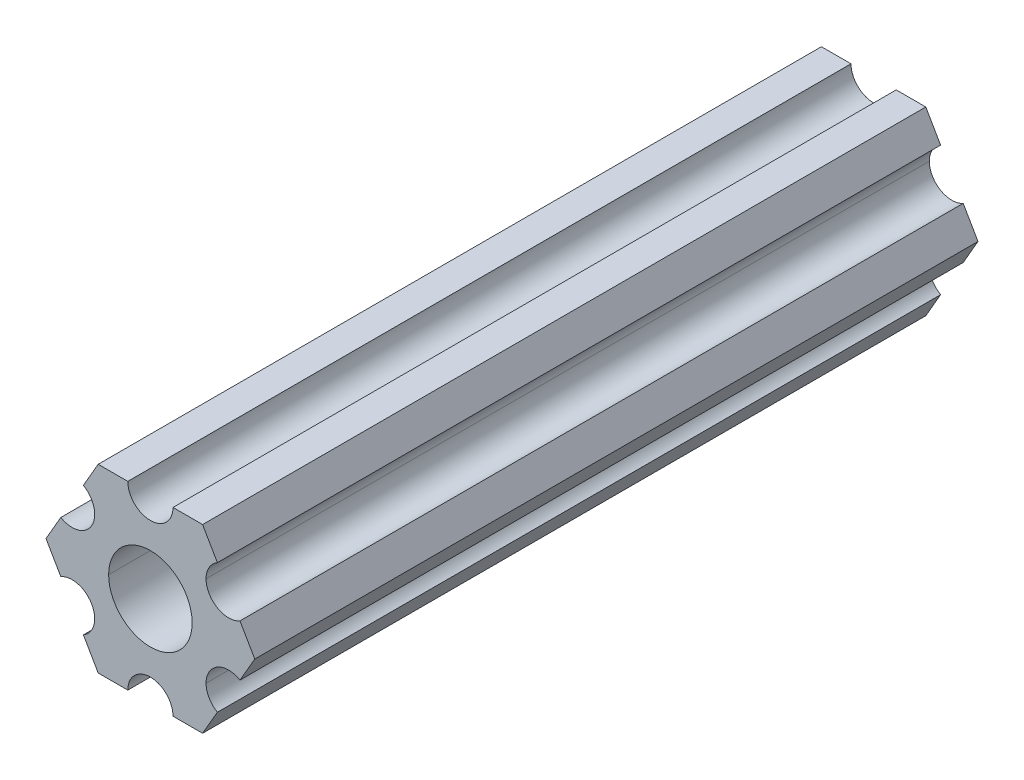
ISO-10303-21;
HEADER;
FILE_DESCRIPTION(('STEP AP214'),'2;1');
FILE_NAME('part.step','',(''),(''),'','','');
FILE_SCHEMA(('AUTOMOTIVE_DESIGN { 1 0 10303 214 1 1 1 1 }'));
ENDSEC;
DATA;
#1=APPLICATION_CONTEXT('core data for automotive mechanical design processes');
#2=APPLICATION_PROTOCOL_DEFINITION('international standard','automotive_design',2000,#1);
#3=PRODUCT_CONTEXT('',#1,'mechanical');
#4=PRODUCT('Part','Part','',(#3));
#5=PRODUCT_RELATED_PRODUCT_CATEGORY('part','',(#4));
#6=PRODUCT_DEFINITION_FORMATION('','',#4);
#7=PRODUCT_DEFINITION_CONTEXT('part definition',#1,'design');
#8=PRODUCT_DEFINITION('design','',#6,#7);
#9=PRODUCT_DEFINITION_SHAPE('','',#8);
#10=(LENGTH_UNIT() NAMED_UNIT(*) SI_UNIT(.MILLI.,.METRE.));
#11=(NAMED_UNIT(*) PLANE_ANGLE_UNIT() SI_UNIT($,.RADIAN.));
#12=(NAMED_UNIT(*) SI_UNIT($,.STERADIAN.) SOLID_ANGLE_UNIT());
#13=UNCERTAINTY_MEASURE_WITH_UNIT(LENGTH_MEASURE(1.E-05),#10,'distance_accuracy_value','');
#14=(GEOMETRIC_REPRESENTATION_CONTEXT(3) GLOBAL_UNCERTAINTY_ASSIGNED_CONTEXT((#13)) GLOBAL_UNIT_ASSIGNED_CONTEXT((#10,
#11,#12)) REPRESENTATION_CONTEXT('',''));
#15=CARTESIAN_POINT('',(0.,0.,0.));
#16=DIRECTION('',(0.,0.,1.));
#17=DIRECTION('',(1.,0.,0.));
#18=AXIS2_PLACEMENT_3D('',#15,#16,#17);
#19=CARTESIAN_POINT('',(0.,0.,304.8));
#20=DIRECTION('',(0.,0.,-1.));
#21=DIRECTION('',(-1.,0.,0.));
#22=AXIS2_PLACEMENT_3D('',#19,#20,#21);
#23=CYLINDRICAL_SURFACE('',#22,2.9337);
#24=CARTESIAN_POINT('',(0.,0.,254.));
#25=DIRECTION('',(0.,0.,-1.));
#26=DIRECTION('',(-1.,0.,0.));
#27=AXIS2_PLACEMENT_3D('',#24,#25,#26);
#28=CIRCLE('',#27,2.9337);
#29=CARTESIAN_POINT('',(-2.9337,0.,254.));
#30=VERTEX_POINT('',#29);
#31=CARTESIAN_POINT('',(2.9337,0.,254.));
#32=VERTEX_POINT('',#31);
#33=EDGE_CURVE('E72',#30,#32,#28,.F.);
#34=ORIENTED_EDGE('',*,*,#33,.F.);
#35=DIRECTION('',(0.,0.,-1.));
#36=VECTOR('',#35,1.);
#37=CARTESIAN_POINT('',(-2.9337,0.,304.8));
#38=LINE('',#37,#36);
#39=CARTESIAN_POINT('',(-2.9337,0.,304.8));
#40=VERTEX_POINT('',#39);
#41=EDGE_CURVE('E389',#40,#30,#38,.T.);
#42=ORIENTED_EDGE('',*,*,#41,.F.);
#43=CARTESIAN_POINT('',(0.,0.,304.8));
#44=DIRECTION('',(0.,0.,1.));
#45=DIRECTION('',(1.,0.,0.));
#46=AXIS2_PLACEMENT_3D('',#43,#44,#45);
#47=CIRCLE('',#46,2.9337);
#48=CARTESIAN_POINT('',(2.9337,0.,304.8));
#49=VERTEX_POINT('',#48);
#50=EDGE_CURVE('E59',#40,#49,#47,.T.);
#51=ORIENTED_EDGE('',*,*,#50,.T.);
#52=DIRECTION('',(0.,0.,-1.));
#53=VECTOR('',#52,1.);
#54=CARTESIAN_POINT('',(2.9337,0.,304.8));
#55=LINE('',#54,#53);
#56=EDGE_CURVE('E327',#49,#32,#55,.T.);
#57=ORIENTED_EDGE('',*,*,#56,.T.);
#58=EDGE_LOOP('',(#34,#42,#51,#57));
#59=FACE_BOUND('',#58,.T.);
#60=ADVANCED_FACE('F50',(#59),#23,.F.);
#61=CARTESIAN_POINT('',(5.49926150638082,-3.17499966684067,304.8));
#62=DIRECTION('',(0.,0.,-1.));
#63=DIRECTION('',(-1.,0.,0.));
#64=AXIS2_PLACEMENT_3D('',#61,#62,#63);
#65=CYLINDRICAL_SURFACE('',#64,1.5875);
#66=CARTESIAN_POINT('',(5.49926150638082,-3.17499966684067,254.));
#67=DIRECTION('',(0.,0.,-1.));
#68=DIRECTION('',(-1.,0.,0.));
#69=AXIS2_PLACEMENT_3D('',#66,#67,#68);
#70=CIRCLE('',#69,1.5875);
#71=CARTESIAN_POINT('',(6.293011423091,-1.80018429024547,254.));
#72=VERTEX_POINT('',#71);
#73=CARTESIAN_POINT('',(3.91176150638082,-3.17499966684067,254.));
#74=VERTEX_POINT('',#73);
#75=EDGE_CURVE('E66',#72,#74,#70,.F.);
#76=ORIENTED_EDGE('',*,*,#75,.F.);
#77=DIRECTION('',(0.,0.,-1.));
#78=VECTOR('',#77,1.);
#79=CARTESIAN_POINT('',(6.29301142309098,-1.80018429024546,304.8));
#80=LINE('',#79,#78);
#81=CARTESIAN_POINT('',(6.29301142309098,-1.80018429024546,304.8));
#82=VERTEX_POINT('',#81);
#83=EDGE_CURVE('E266',#82,#72,#80,.T.);
#84=ORIENTED_EDGE('',*,*,#83,.F.);
#85=CARTESIAN_POINT('',(5.49926150638082,-3.17499966684067,304.8));
#86=DIRECTION('',(0.,0.,-1.));
#87=DIRECTION('',(1.,0.,0.));
#88=AXIS2_PLACEMENT_3D('',#85,#86,#87);
#89=CIRCLE('',#88,1.5875);
#90=CARTESIAN_POINT('',(3.91176150638082,-3.17499966684067,304.8));
#91=VERTEX_POINT('',#90);
#92=EDGE_CURVE('E261',#91,#82,#89,.T.);
#93=ORIENTED_EDGE('',*,*,#92,.F.);
#94=DIRECTION('',(0.,0.,-1.));
#95=VECTOR('',#94,1.);
#96=CARTESIAN_POINT('',(3.91176150638082,-3.17499966684067,304.8));
#97=LINE('',#96,#95);
#98=EDGE_CURVE('E323',#91,#74,#97,.T.);
#99=ORIENTED_EDGE('',*,*,#98,.T.);
#100=EDGE_LOOP('',(#76,#84,#93,#99));
#101=FACE_BOUND('',#100,.T.);
#102=ADVANCED_FACE('F500',(#101),#65,.F.);
#103=CARTESIAN_POINT('',(5.49926112168156,3.17500033315934,304.8));
#104=DIRECTION('',(0.,0.,-1.));
#105=DIRECTION('',(-1.,0.,0.));
#106=AXIS2_PLACEMENT_3D('',#103,#104,#105);
#107=CYLINDRICAL_SURFACE('',#106,1.5875);
#108=CARTESIAN_POINT('',(5.49926112168156,3.17500033315934,254.));
#109=DIRECTION('',(0.,0.,-1.));
#110=DIRECTION('',(-1.,0.,0.));
#111=AXIS2_PLACEMENT_3D('',#108,#109,#110);
#112=CIRCLE('',#111,1.5875);
#113=CARTESIAN_POINT('',(4.70551103839173,4.54981561357973,254.));
#114=VERTEX_POINT('',#113);
#115=CARTESIAN_POINT('',(3.91176112168156,3.17500033315934,254.));
#116=VERTEX_POINT('',#115);
#117=EDGE_CURVE('E393',#114,#116,#112,.F.);
#118=ORIENTED_EDGE('',*,*,#117,.F.);
#119=DIRECTION('',(0.,0.,-1.));
#120=VECTOR('',#119,1.);
#121=CARTESIAN_POINT('',(4.70551103839172,4.54981561357972,304.8));
#122=LINE('',#121,#120);
#123=CARTESIAN_POINT('',(4.70551103839172,4.54981561357972,304.8));
#124=VERTEX_POINT('',#123);
#125=EDGE_CURVE('E283',#124,#114,#122,.T.);
#126=ORIENTED_EDGE('',*,*,#125,.F.);
#127=CARTESIAN_POINT('',(5.49926112168156,3.17500033315934,304.8));
#128=DIRECTION('',(0.,0.,-1.));
#129=DIRECTION('',(1.,0.,0.));
#130=AXIS2_PLACEMENT_3D('',#127,#128,#129);
#131=CIRCLE('',#130,1.5875);
#132=CARTESIAN_POINT('',(3.91176112168156,3.17500033315934,304.8));
#133=VERTEX_POINT('',#132);
#134=EDGE_CURVE('E272',#133,#124,#131,.T.);
#135=ORIENTED_EDGE('',*,*,#134,.F.);
#136=DIRECTION('',(0.,0.,-1.));
#137=VECTOR('',#136,1.);
#138=CARTESIAN_POINT('',(3.91176112168156,3.17500033315934,304.8));
#139=LINE('',#138,#137);
#140=EDGE_CURVE('E328',#133,#116,#139,.T.);
#141=ORIENTED_EDGE('',*,*,#140,.T.);
#142=EDGE_LOOP('',(#118,#126,#135,#141));
#143=FACE_BOUND('',#142,.T.);
#144=ADVANCED_FACE('F524',(#143),#107,.F.);
#145=CARTESIAN_POINT('',(6.29301142309098,-1.80018429024546,304.8));
#146=DIRECTION('',(-0.866025434075723,0.499999947533953,0.));
#147=DIRECTION('',(0.,0.,1.));
#148=AXIS2_PLACEMENT_3D('',#145,#146,#147);
#149=PLANE('',#148);
#150=DIRECTION('',(-0.49999994753396,-0.866025434075719,0.));
#151=VECTOR('',#150,1.);
#152=CARTESIAN_POINT('',(7.33234841870827,4.44212465422478E-07,254.));
#153=LINE('',#152,#151);
#154=CARTESIAN_POINT('',(7.33234841870827,4.44212465422478E-07,254.));
#155=VERTEX_POINT('',#154);
#156=EDGE_CURVE('E444',#155,#72,#153,.T.);
#157=ORIENTED_EDGE('',*,*,#156,.F.);
#158=DIRECTION('',(0.,0.,-1.));
#159=VECTOR('',#158,1.);
#160=CARTESIAN_POINT('',(7.33234841870827,4.44212519169686E-07,304.8));
#161=LINE('',#160,#159);
#162=CARTESIAN_POINT('',(7.33234841870827,4.44212519169686E-07,304.8));
#163=VERTEX_POINT('',#162);
#164=EDGE_CURVE('E300',#163,#155,#161,.T.);
#165=ORIENTED_EDGE('',*,*,#164,.F.);
#166=DIRECTION('',(0.499999947533953,0.866025434075723,0.));
#167=VECTOR('',#166,1.);
#168=CARTESIAN_POINT('',(6.29301142309098,-1.80018429024546,304.8));
#169=LINE('',#168,#167);
#170=EDGE_CURVE('E337',#82,#163,#169,.T.);
#171=ORIENTED_EDGE('',*,*,#170,.F.);
#172=ORIENTED_EDGE('',*,*,#83,.T.);
#173=EDGE_LOOP('',(#157,#165,#171,#172));
#174=FACE_BOUND('',#173,.T.);
#175=ADVANCED_FACE('F497',(#174),#149,.F.);
#176=CARTESIAN_POINT('',(7.33234841870827,4.44212519169686E-07,304.8));
#177=DIRECTION('',(-0.866025373493145,-0.500000052466057,0.));
#178=DIRECTION('',(-0.500000052466057,0.866025373493145,0.));
#179=AXIS2_PLACEMENT_3D('',#176,#177,#178);
#180=PLANE('',#179);
#181=DIRECTION('',(0.500000052466038,-0.866025373493155,0.));
#182=VECTOR('',#181,1.);
#183=CARTESIAN_POINT('',(3.66617382465485,6.35000022210625,254.));
#184=LINE('',#183,#182);
#185=CARTESIAN_POINT('',(6.29301120497141,1.80018505273896,254.));
#186=VERTEX_POINT('',#185);
#187=EDGE_CURVE('E488',#186,#155,#184,.T.);
#188=ORIENTED_EDGE('',*,*,#187,.F.);
#189=DIRECTION('',(0.,0.,-1.));
#190=VECTOR('',#189,1.);
#191=CARTESIAN_POINT('',(6.29301120497139,1.80018505273894,304.8));
#192=LINE('',#191,#190);
#193=CARTESIAN_POINT('',(6.29301120497139,1.80018505273894,304.8));
#194=VERTEX_POINT('',#193);
#195=EDGE_CURVE('E297',#194,#186,#192,.T.);
#196=ORIENTED_EDGE('',*,*,#195,.F.);
#197=DIRECTION('',(-0.500000052466056,0.866025373493145,0.));
#198=VECTOR('',#197,1.);
#199=CARTESIAN_POINT('',(7.33234841870827,4.44212519169686E-07,304.8));
#200=LINE('',#199,#198);
#201=EDGE_CURVE('E271',#163,#194,#200,.T.);
#202=ORIENTED_EDGE('',*,*,#201,.F.);
#203=ORIENTED_EDGE('',*,*,#164,.T.);
#204=EDGE_LOOP('',(#188,#196,#202,#203));
#205=FACE_BOUND('',#204,.T.);
#206=ADVANCED_FACE('F52',(#205),#180,.F.);
#207=CARTESIAN_POINT('',(5.49926112168156,3.17500033315934,304.8));
#208=DIRECTION('',(0.,0.,-1.));
#209=DIRECTION('',(-1.,0.,0.));
#210=AXIS2_PLACEMENT_3D('',#207,#208,#209);
#211=CYLINDRICAL_SURFACE('',#210,1.5875);
#212=CARTESIAN_POINT('',(5.49926112168156,3.17500033315934,254.));
#213=DIRECTION('',(0.,0.,-1.));
#214=DIRECTION('',(-1.,0.,0.));
#215=AXIS2_PLACEMENT_3D('',#212,#213,#214);
#216=CIRCLE('',#215,1.5875);
#217=EDGE_CURVE('E469',#116,#186,#216,.F.);
#218=ORIENTED_EDGE('',*,*,#217,.F.);
#219=ORIENTED_EDGE('',*,*,#140,.F.);
#220=CARTESIAN_POINT('',(5.49926112168156,3.17500033315934,304.8));
#221=DIRECTION('',(0.,0.,-1.));
#222=DIRECTION('',(1.,0.,0.));
#223=AXIS2_PLACEMENT_3D('',#220,#221,#222);
#224=CIRCLE('',#223,1.5875);
#225=EDGE_CURVE('E267',#194,#133,#224,.T.);
#226=ORIENTED_EDGE('',*,*,#225,.F.);
#227=ORIENTED_EDGE('',*,*,#195,.T.);
#228=EDGE_LOOP('',(#218,#219,#226,#227));
#229=FACE_BOUND('',#228,.T.);
#230=ADVANCED_FACE('F528',(#229),#211,.F.);
#231=CARTESIAN_POINT('',(4.70551103839172,4.54981561357972,304.8));
#232=DIRECTION('',(-0.866025373493151,-0.500000052466046,0.));
#233=DIRECTION('',(-0.500000052466046,0.866025373493151,0.));
#234=AXIS2_PLACEMENT_3D('',#231,#232,#233);
#235=PLANE('',#234);
#236=CARTESIAN_POINT('',(3.66617382465485,6.35000022210625,254.));
#237=VERTEX_POINT('',#236);
#238=EDGE_CURVE('E489',#237,#114,#184,.T.);
#239=ORIENTED_EDGE('',*,*,#238,.F.);
#240=DIRECTION('',(0.,0.,-1.));
#241=VECTOR('',#240,1.);
#242=CARTESIAN_POINT('',(3.66617382465481,6.35000022210627,304.8));
#243=LINE('',#242,#241);
#244=CARTESIAN_POINT('',(3.66617382465481,6.35000022210627,304.8));
#245=VERTEX_POINT('',#244);
#246=EDGE_CURVE('E279',#245,#237,#243,.T.);
#247=ORIENTED_EDGE('',*,*,#246,.F.);
#248=DIRECTION('',(-0.500000052466046,0.866025373493151,0.));
#249=VECTOR('',#248,1.);
#250=CARTESIAN_POINT('',(4.70551103839172,4.54981561357972,304.8));
#251=LINE('',#250,#249);
#252=EDGE_CURVE('E346',#124,#245,#251,.T.);
#253=ORIENTED_EDGE('',*,*,#252,.F.);
#254=ORIENTED_EDGE('',*,*,#125,.T.);
#255=EDGE_LOOP('',(#239,#247,#253,#254));
#256=FACE_BOUND('',#255,.T.);
#257=ADVANCED_FACE('F531',(#256),#235,.F.);
#258=CARTESIAN_POINT('',(3.66617382465481,6.35000022210627,304.8));
#259=DIRECTION('',(6.05825850611185E-08,-1.,0.));
#260=DIRECTION('',(0.,0.,-1.));
#261=AXIS2_PLACEMENT_3D('',#258,#259,#260);
#262=PLANE('',#261);
#263=DIRECTION('',(0.999999999999998,6.05825637375717E-08,0.));
#264=VECTOR('',#263,1.);
#265=CARTESIAN_POINT('',(-3.66617459405341,6.34999977789379,254.));
#266=LINE('',#265,#264);
#267=CARTESIAN_POINT('',(1.58749961530074,6.35000009617484,254.));
#268=VERTEX_POINT('',#267);
#269=EDGE_CURVE('E241',#268,#237,#266,.T.);
#270=ORIENTED_EDGE('',*,*,#269,.F.);
#271=DIRECTION('',(0.,0.,-1.));
#272=VECTOR('',#271,1.);
#273=CARTESIAN_POINT('',(1.58749961530074,6.35000009617482,304.8));
#274=LINE('',#273,#272);
#275=CARTESIAN_POINT('',(1.58749961530074,6.35000009617482,304.8));
#276=VERTEX_POINT('',#275);
#277=EDGE_CURVE('E284',#276,#268,#274,.T.);
#278=ORIENTED_EDGE('',*,*,#277,.F.);
#279=DIRECTION('',(-1.,-6.05825850611185E-08,0.));
#280=VECTOR('',#279,1.);
#281=CARTESIAN_POINT('',(3.66617382465481,6.35000022210627,304.8));
#282=LINE('',#281,#280);
#283=EDGE_CURVE('E396',#245,#276,#282,.T.);
#284=ORIENTED_EDGE('',*,*,#283,.F.);
#285=ORIENTED_EDGE('',*,*,#246,.T.);
#286=EDGE_LOOP('',(#270,#278,#284,#285));
#287=FACE_BOUND('',#286,.T.);
#288=ADVANCED_FACE('F526',(#287),#262,.F.);
#289=CARTESIAN_POINT('',(-3.84699260060323E-07,6.35,304.8));
#290=DIRECTION('',(0.,0.,-1.));
#291=DIRECTION('',(-1.,0.,0.));
#292=AXIS2_PLACEMENT_3D('',#289,#290,#291);
#293=CYLINDRICAL_SURFACE('',#292,1.5875);
#294=CARTESIAN_POINT('',(-3.84699260060323E-07,6.35,254.));
#295=DIRECTION('',(0.,0.,-1.));
#296=DIRECTION('',(-1.,0.,0.));
#297=AXIS2_PLACEMENT_3D('',#294,#295,#296);
#298=CIRCLE('',#297,1.5875);
#299=CARTESIAN_POINT('',(-1.58750038469926,6.3499999038252,254.));
#300=VERTEX_POINT('',#299);
#301=EDGE_CURVE('E466',#300,#268,#298,.F.);
#302=ORIENTED_EDGE('',*,*,#301,.F.);
#303=DIRECTION('',(0.,0.,-1.));
#304=VECTOR('',#303,1.);
#305=CARTESIAN_POINT('',(-1.58750038469926,6.34999990382519,304.8));
#306=LINE('',#305,#304);
#307=CARTESIAN_POINT('',(-1.58750038469926,6.34999990382519,304.8));
#308=VERTEX_POINT('',#307);
#309=EDGE_CURVE('E347',#308,#300,#306,.T.);
#310=ORIENTED_EDGE('',*,*,#309,.F.);
#311=CARTESIAN_POINT('',(-3.84699260060323E-07,6.35,304.8));
#312=DIRECTION('',(0.,0.,-1.));
#313=DIRECTION('',(1.,0.,0.));
#314=AXIS2_PLACEMENT_3D('',#311,#312,#313);
#315=CIRCLE('',#314,1.5875);
#316=EDGE_CURVE('E399',#276,#308,#315,.T.);
#317=ORIENTED_EDGE('',*,*,#316,.F.);
#318=ORIENTED_EDGE('',*,*,#277,.T.);
#319=EDGE_LOOP('',(#302,#310,#317,#318));
#320=FACE_BOUND('',#319,.T.);
#321=ADVANCED_FACE('F542',(#320),#293,.F.);
#322=CARTESIAN_POINT('',(-1.58750038469926,6.34999990382518,304.8));
#323=DIRECTION('',(6.05825963273174E-08,-1.,0.));
#324=DIRECTION('',(0.,0.,-1.));
#325=AXIS2_PLACEMENT_3D('',#322,#323,#324);
#326=PLANE('',#325);
#327=CARTESIAN_POINT('',(-3.66617459405341,6.34999977789379,254.));
#328=VERTEX_POINT('',#327);
#329=EDGE_CURVE('E486',#328,#300,#266,.T.);
#330=ORIENTED_EDGE('',*,*,#329,.F.);
#331=DIRECTION('',(0.,0.,-1.));
#332=VECTOR('',#331,1.);
#333=CARTESIAN_POINT('',(-3.66617459405349,6.3499997778937,304.8));
#334=LINE('',#333,#332);
#335=CARTESIAN_POINT('',(-3.66617459405349,6.3499997778937,304.8));
#336=VERTEX_POINT('',#335);
#337=EDGE_CURVE('E287',#336,#328,#334,.T.);
#338=ORIENTED_EDGE('',*,*,#337,.F.);
#339=DIRECTION('',(-1.,-6.05825963273174E-08,0.));
#340=VECTOR('',#339,1.);
#341=CARTESIAN_POINT('',(-1.58750038469926,6.34999990382518,304.8));
#342=LINE('',#341,#340);
#343=EDGE_CURVE('E374',#308,#336,#342,.T.);
#344=ORIENTED_EDGE('',*,*,#343,.F.);
#345=ORIENTED_EDGE('',*,*,#309,.T.);
#346=EDGE_LOOP('',(#330,#338,#344,#345));
#347=FACE_BOUND('',#346,.T.);
#348=ADVANCED_FACE('F538',(#347),#326,.F.);
#349=CARTESIAN_POINT('',(-3.66617459405349,6.3499997778937,304.8));
#350=DIRECTION('',(0.866025434075729,-0.499999947533942,0.));
#351=DIRECTION('',(0.,0.,-1.));
#352=AXIS2_PLACEMENT_3D('',#349,#350,#351);
#353=PLANE('',#352);
#354=DIRECTION('',(0.49999994753396,0.866025434075719,0.));
#355=VECTOR('',#354,1.);
#356=CARTESIAN_POINT('',(-7.33234841870827,-4.44212463687754E-07,254.));
#357=LINE('',#356,#355);
#358=CARTESIAN_POINT('',(-4.70551158967067,4.54981504343588,254.));
#359=VERTEX_POINT('',#358);
#360=EDGE_CURVE('E242',#359,#328,#357,.T.);
#361=ORIENTED_EDGE('',*,*,#360,.F.);
#362=DIRECTION('',(0.,0.,-1.));
#363=VECTOR('',#362,1.);
#364=CARTESIAN_POINT('',(-4.70551158967065,4.54981504343587,304.8));
#365=LINE('',#364,#363);
#366=CARTESIAN_POINT('',(-4.70551158967065,4.54981504343587,304.8));
#367=VERTEX_POINT('',#366);
#368=EDGE_CURVE('E254',#367,#359,#365,.T.);
#369=ORIENTED_EDGE('',*,*,#368,.F.);
#370=DIRECTION('',(-0.499999947533943,-0.866025434075729,0.));
#371=VECTOR('',#370,1.);
#372=CARTESIAN_POINT('',(-3.66617459405349,6.3499997778937,304.8));
#373=LINE('',#372,#371);
#374=EDGE_CURVE('E277',#336,#367,#373,.T.);
#375=ORIENTED_EDGE('',*,*,#374,.F.);
#376=ORIENTED_EDGE('',*,*,#337,.T.);
#377=EDGE_LOOP('',(#361,#369,#375,#376));
#378=FACE_BOUND('',#377,.T.);
#379=ADVANCED_FACE('F541',(#378),#353,.F.);
#380=CARTESIAN_POINT('',(-5.49926150638082,3.17499966684067,304.8));
#381=DIRECTION('',(0.,0.,-1.));
#382=DIRECTION('',(-1.,0.,0.));
#383=AXIS2_PLACEMENT_3D('',#380,#381,#382);
#384=CYLINDRICAL_SURFACE('',#383,1.5875);
#385=CARTESIAN_POINT('',(-5.49926150638082,3.17499966684067,254.));
#386=DIRECTION('',(0.,0.,-1.));
#387=DIRECTION('',(-1.,0.,0.));
#388=AXIS2_PLACEMENT_3D('',#385,#386,#387);
#389=CIRCLE('',#388,1.5875);
#390=CARTESIAN_POINT('',(-6.29301142309099,1.80018429024547,254.));
#391=VERTEX_POINT('',#390);
#392=EDGE_CURVE('E463',#391,#359,#389,.F.);
#393=ORIENTED_EDGE('',*,*,#392,.F.);
#394=DIRECTION('',(0.,0.,-1.));
#395=VECTOR('',#394,1.);
#396=CARTESIAN_POINT('',(-6.29301142309098,1.80018429024547,304.8));
#397=LINE('',#396,#395);
#398=CARTESIAN_POINT('',(-6.29301142309098,1.80018429024547,304.8));
#399=VERTEX_POINT('',#398);
#400=EDGE_CURVE('E239',#399,#391,#397,.T.);
#401=ORIENTED_EDGE('',*,*,#400,.F.);
#402=CARTESIAN_POINT('',(-5.49926150638082,3.17499966684067,304.8));
#403=DIRECTION('',(0.,0.,-1.));
#404=DIRECTION('',(1.,0.,0.));
#405=AXIS2_PLACEMENT_3D('',#402,#403,#404);
#406=CIRCLE('',#405,1.5875);
#407=EDGE_CURVE('E273',#367,#399,#406,.T.);
#408=ORIENTED_EDGE('',*,*,#407,.F.);
#409=ORIENTED_EDGE('',*,*,#368,.T.);
#410=EDGE_LOOP('',(#393,#401,#408,#409));
#411=FACE_BOUND('',#410,.T.);
#412=ADVANCED_FACE('F558',(#411),#384,.F.);
#413=CARTESIAN_POINT('',(-6.29301142309098,1.80018429024547,304.8));
#414=DIRECTION('',(0.866025434075724,-0.499999947533952,0.));
#415=DIRECTION('',(0.,0.,-1.));
#416=AXIS2_PLACEMENT_3D('',#413,#414,#415);
#417=PLANE('',#416);
#418=CARTESIAN_POINT('',(-7.33234841870827,-4.44212463687754E-07,254.));
#419=VERTEX_POINT('',#418);
#420=EDGE_CURVE('E222',#419,#391,#357,.T.);
#421=ORIENTED_EDGE('',*,*,#420,.F.);
#422=DIRECTION('',(0.,0.,-1.));
#423=VECTOR('',#422,1.);
#424=CARTESIAN_POINT('',(-7.33234841870827,-4.44212523790841E-07,304.8));
#425=LINE('',#424,#423);
#426=CARTESIAN_POINT('',(-7.33234841870827,-4.44212523790841E-07,304.8));
#427=VERTEX_POINT('',#426);
#428=EDGE_CURVE('E237',#427,#419,#425,.T.);
#429=ORIENTED_EDGE('',*,*,#428,.F.);
#430=DIRECTION('',(-0.499999947533951,-0.866025434075724,0.));
#431=VECTOR('',#430,1.);
#432=CARTESIAN_POINT('',(-6.29301142309098,1.80018429024547,304.8));
#433=LINE('',#432,#431);
#434=EDGE_CURVE('E278',#399,#427,#433,.T.);
#435=ORIENTED_EDGE('',*,*,#434,.F.);
#436=ORIENTED_EDGE('',*,*,#400,.T.);
#437=EDGE_LOOP('',(#421,#429,#435,#436));
#438=FACE_BOUND('',#437,.T.);
#439=ADVANCED_FACE('F236',(#438),#417,.F.);
#440=CARTESIAN_POINT('',(-7.33234841870827,-4.44212523790841E-07,304.8));
#441=DIRECTION('',(0.866025373493151,0.500000052466045,0.));
#442=DIRECTION('',(0.,0.,-1.));
#443=AXIS2_PLACEMENT_3D('',#440,#441,#442);
#444=PLANE('',#443);
#445=DIRECTION('',(-0.500000052466038,0.866025373493155,0.));
#446=VECTOR('',#445,1.);
#447=CARTESIAN_POINT('',(-3.66617382465485,-6.35000022210625,254.));
#448=LINE('',#447,#446);
#449=CARTESIAN_POINT('',(-6.29301120497141,-1.80018505273896,254.));
#450=VERTEX_POINT('',#449);
#451=EDGE_CURVE('E219',#450,#419,#448,.T.);
#452=ORIENTED_EDGE('',*,*,#451,.F.);
#453=DIRECTION('',(0.,0.,-1.));
#454=VECTOR('',#453,1.);
#455=CARTESIAN_POINT('',(-6.29301120497141,-1.80018505273897,304.8));
#456=LINE('',#455,#454);
#457=CARTESIAN_POINT('',(-6.29301120497141,-1.80018505273897,304.8));
#458=VERTEX_POINT('',#457);
#459=EDGE_CURVE('E249',#458,#450,#456,.T.);
#460=ORIENTED_EDGE('',*,*,#459,.F.);
#461=DIRECTION('',(0.500000052466045,-0.866025373493151,0.));
#462=VECTOR('',#461,1.);
#463=CARTESIAN_POINT('',(-7.33234841870827,-4.44212523790841E-07,304.8));
#464=LINE('',#463,#462);
#465=EDGE_CURVE('E246',#427,#458,#464,.T.);
#466=ORIENTED_EDGE('',*,*,#465,.F.);
#467=ORIENTED_EDGE('',*,*,#428,.T.);
#468=EDGE_LOOP('',(#452,#460,#466,#467));
#469=FACE_BOUND('',#468,.T.);
#470=ADVANCED_FACE('F244',(#469),#444,.F.);
#471=CARTESIAN_POINT('',(-5.49926112168156,-3.17500033315934,304.8));
#472=DIRECTION('',(0.,0.,-1.));
#473=DIRECTION('',(-1.,0.,0.));
#474=AXIS2_PLACEMENT_3D('',#471,#472,#473);
#475=CYLINDRICAL_SURFACE('',#474,1.5875);
#476=CARTESIAN_POINT('',(-5.49926112168156,-3.17500033315934,254.));
#477=DIRECTION('',(0.,0.,-1.));
#478=DIRECTION('',(-1.,0.,0.));
#479=AXIS2_PLACEMENT_3D('',#476,#477,#478);
#480=CIRCLE('',#479,1.5875);
#481=CARTESIAN_POINT('',(-4.70551103839173,-4.54981561357973,254.));
#482=VERTEX_POINT('',#481);
#483=EDGE_CURVE('E225',#482,#450,#480,.F.);
#484=ORIENTED_EDGE('',*,*,#483,.F.);
#485=DIRECTION('',(0.,0.,-1.));
#486=VECTOR('',#485,1.);
#487=CARTESIAN_POINT('',(-4.70551103839172,-4.54981561357972,304.8));
#488=LINE('',#487,#486);
#489=CARTESIAN_POINT('',(-4.70551103839172,-4.54981561357972,304.8));
#490=VERTEX_POINT('',#489);
#491=EDGE_CURVE('E256',#490,#482,#488,.T.);
#492=ORIENTED_EDGE('',*,*,#491,.F.);
#493=CARTESIAN_POINT('',(-5.49926112168156,-3.17500033315934,304.8));
#494=DIRECTION('',(0.,0.,-1.));
#495=DIRECTION('',(1.,0.,0.));
#496=AXIS2_PLACEMENT_3D('',#493,#494,#495);
#497=CIRCLE('',#496,1.5875);
#498=EDGE_CURVE('E318',#458,#490,#497,.T.);
#499=ORIENTED_EDGE('',*,*,#498,.F.);
#500=ORIENTED_EDGE('',*,*,#459,.T.);
#501=EDGE_LOOP('',(#484,#492,#499,#500));
#502=FACE_BOUND('',#501,.T.);
#503=ADVANCED_FACE('F549',(#502),#475,.F.);
#504=CARTESIAN_POINT('',(-4.70551103839172,-4.54981561357972,304.8));
#505=DIRECTION('',(0.866025373493152,0.500000052466045,0.));
#506=DIRECTION('',(0.,0.,-1.));
#507=AXIS2_PLACEMENT_3D('',#504,#505,#506);
#508=PLANE('',#507);
#509=CARTESIAN_POINT('',(-3.66617382465485,-6.35000022210625,254.));
#510=VERTEX_POINT('',#509);
#511=EDGE_CURVE('E231',#510,#482,#448,.T.);
#512=ORIENTED_EDGE('',*,*,#511,.F.);
#513=DIRECTION('',(0.,0.,-1.));
#514=VECTOR('',#513,1.);
#515=CARTESIAN_POINT('',(-3.66617382465481,-6.35000022210628,304.8));
#516=LINE('',#515,#514);
#517=CARTESIAN_POINT('',(-3.66617382465481,-6.35000022210628,304.8));
#518=VERTEX_POINT('',#517);
#519=EDGE_CURVE('E338',#518,#510,#516,.T.);
#520=ORIENTED_EDGE('',*,*,#519,.F.);
#521=DIRECTION('',(0.500000052466045,-0.866025373493152,0.));
#522=VECTOR('',#521,1.);
#523=CARTESIAN_POINT('',(-4.70551103839172,-4.54981561357972,304.8));
#524=LINE('',#523,#522);
#525=EDGE_CURVE('E322',#490,#518,#524,.T.);
#526=ORIENTED_EDGE('',*,*,#525,.F.);
#527=ORIENTED_EDGE('',*,*,#491,.T.);
#528=EDGE_LOOP('',(#512,#520,#526,#527));
#529=FACE_BOUND('',#528,.T.);
#530=ADVANCED_FACE('F482',(#529),#508,.F.);
#531=CARTESIAN_POINT('',(-3.66617382465481,-6.35000022210628,304.8));
#532=DIRECTION('',(-6.05825854783851E-08,1.,0.));
#533=DIRECTION('',(0.,0.,1.));
#534=AXIS2_PLACEMENT_3D('',#531,#532,#533);
#535=PLANE('',#534);
#536=DIRECTION('',(-0.999999999999998,-6.05825637375717E-08,0.));
#537=VECTOR('',#536,1.);
#538=CARTESIAN_POINT('',(3.66617459405341,-6.34999977789379,254.));
#539=LINE('',#538,#537);
#540=CARTESIAN_POINT('',(-1.58749961530073,-6.35000009617484,254.));
#541=VERTEX_POINT('',#540);
#542=EDGE_CURVE('E439',#541,#510,#539,.T.);
#543=ORIENTED_EDGE('',*,*,#542,.F.);
#544=DIRECTION('',(0.,0.,-1.));
#545=VECTOR('',#544,1.);
#546=CARTESIAN_POINT('',(-1.58749961530073,-6.35000009617482,304.8));
#547=LINE('',#546,#545);
#548=CARTESIAN_POINT('',(-1.58749961530073,-6.35000009617482,304.8));
#549=VERTEX_POINT('',#548);
#550=EDGE_CURVE('E342',#549,#541,#547,.T.);
#551=ORIENTED_EDGE('',*,*,#550,.F.);
#552=DIRECTION('',(1.,6.05825854783851E-08,0.));
#553=VECTOR('',#552,1.);
#554=CARTESIAN_POINT('',(-3.66617382465481,-6.35000022210628,304.8));
#555=LINE('',#554,#553);
#556=EDGE_CURVE('E329',#518,#549,#555,.T.);
#557=ORIENTED_EDGE('',*,*,#556,.F.);
#558=ORIENTED_EDGE('',*,*,#519,.T.);
#559=EDGE_LOOP('',(#543,#551,#557,#558));
#560=FACE_BOUND('',#559,.T.);
#561=ADVANCED_FACE('F437',(#560),#535,.F.);
#562=CARTESIAN_POINT('',(3.8469926204343E-07,-6.35,304.8));
#563=DIRECTION('',(0.,0.,-1.));
#564=DIRECTION('',(-1.,0.,0.));
#565=AXIS2_PLACEMENT_3D('',#562,#563,#564);
#566=CYLINDRICAL_SURFACE('',#565,1.5875);
#567=CARTESIAN_POINT('',(3.8469926204343E-07,-6.35,254.));
#568=DIRECTION('',(0.,0.,-1.));
#569=DIRECTION('',(-1.,0.,0.));
#570=AXIS2_PLACEMENT_3D('',#567,#568,#569);
#571=CIRCLE('',#570,1.5875);
#572=CARTESIAN_POINT('',(1.58750038469926,-6.3499999038252,254.));
#573=VERTEX_POINT('',#572);
#574=EDGE_CURVE('E433',#573,#541,#571,.F.);
#575=ORIENTED_EDGE('',*,*,#574,.F.);
#576=DIRECTION('',(0.,0.,-1.));
#577=VECTOR('',#576,1.);
#578=CARTESIAN_POINT('',(1.58750038469926,-6.34999990382518,304.8));
#579=LINE('',#578,#577);
#580=CARTESIAN_POINT('',(1.58750038469926,-6.34999990382518,304.8));
#581=VERTEX_POINT('',#580);
#582=EDGE_CURVE('E293',#581,#573,#579,.T.);
#583=ORIENTED_EDGE('',*,*,#582,.F.);
#584=CARTESIAN_POINT('',(3.8469926204343E-07,-6.35,304.8));
#585=DIRECTION('',(0.,0.,-1.));
#586=DIRECTION('',(1.,0.,0.));
#587=AXIS2_PLACEMENT_3D('',#584,#585,#586);
#588=CIRCLE('',#587,1.5875);
#589=EDGE_CURVE('E333',#549,#581,#588,.T.);
#590=ORIENTED_EDGE('',*,*,#589,.F.);
#591=ORIENTED_EDGE('',*,*,#550,.T.);
#592=EDGE_LOOP('',(#575,#583,#590,#591));
#593=FACE_BOUND('',#592,.T.);
#594=ADVANCED_FACE('F432',(#593),#566,.F.);
#595=CARTESIAN_POINT('',(1.58750038469926,-6.34999990382518,304.8));
#596=DIRECTION('',(-6.05825721258438E-08,1.,0.));
#597=DIRECTION('',(0.,0.,1.));
#598=AXIS2_PLACEMENT_3D('',#595,#596,#597);
#599=PLANE('',#598);
#600=CARTESIAN_POINT('',(3.66617459405341,-6.34999977789379,254.));
#601=VERTEX_POINT('',#600);
#602=EDGE_CURVE('E443',#601,#573,#539,.T.);
#603=ORIENTED_EDGE('',*,*,#602,.F.);
#604=DIRECTION('',(0.,0.,-1.));
#605=VECTOR('',#604,1.);
#606=CARTESIAN_POINT('',(3.66617459405346,-6.34999977789375,304.8));
#607=LINE('',#606,#605);
#608=CARTESIAN_POINT('',(3.66617459405346,-6.34999977789375,304.8));
#609=VERTEX_POINT('',#608);
#610=EDGE_CURVE('E289',#609,#601,#607,.T.);
#611=ORIENTED_EDGE('',*,*,#610,.F.);
#612=DIRECTION('',(1.,6.05825721258438E-08,0.));
#613=VECTOR('',#612,1.);
#614=CARTESIAN_POINT('',(1.58750038469926,-6.34999990382518,304.8));
#615=LINE('',#614,#613);
#616=EDGE_CURVE('E357',#581,#609,#615,.T.);
#617=ORIENTED_EDGE('',*,*,#616,.F.);
#618=ORIENTED_EDGE('',*,*,#582,.T.);
#619=EDGE_LOOP('',(#603,#611,#617,#618));
#620=FACE_BOUND('',#619,.T.);
#621=ADVANCED_FACE('F506',(#620),#599,.F.);
#622=CARTESIAN_POINT('',(3.66617459405346,-6.34999977789375,304.8));
#623=DIRECTION('',(-0.86602543407573,0.499999947533941,0.));
#624=DIRECTION('',(0.,0.,1.));
#625=AXIS2_PLACEMENT_3D('',#622,#623,#624);
#626=PLANE('',#625);
#627=CARTESIAN_POINT('',(4.70551158967067,-4.54981504343588,254.));
#628=VERTEX_POINT('',#627);
#629=EDGE_CURVE('E448',#628,#601,#153,.T.);
#630=ORIENTED_EDGE('',*,*,#629,.F.);
#631=DIRECTION('',(0.,0.,-1.));
#632=VECTOR('',#631,1.);
#633=CARTESIAN_POINT('',(4.70551158967065,-4.54981504343587,304.8));
#634=LINE('',#633,#632);
#635=CARTESIAN_POINT('',(4.70551158967065,-4.54981504343587,304.8));
#636=VERTEX_POINT('',#635);
#637=EDGE_CURVE('E294',#636,#628,#634,.T.);
#638=ORIENTED_EDGE('',*,*,#637,.F.);
#639=DIRECTION('',(0.499999947533941,0.86602543407573,0.));
#640=VECTOR('',#639,1.);
#641=CARTESIAN_POINT('',(3.66617459405346,-6.34999977789375,304.8));
#642=LINE('',#641,#640);
#643=EDGE_CURVE('E361',#609,#636,#642,.T.);
#644=ORIENTED_EDGE('',*,*,#643,.F.);
#645=ORIENTED_EDGE('',*,*,#610,.T.);
#646=EDGE_LOOP('',(#630,#638,#644,#645));
#647=FACE_BOUND('',#646,.T.);
#648=ADVANCED_FACE('F505',(#647),#626,.F.);
#649=CARTESIAN_POINT('',(5.49926150638082,-3.17499966684067,304.8));
#650=DIRECTION('',(0.,0.,-1.));
#651=DIRECTION('',(-1.,0.,0.));
#652=AXIS2_PLACEMENT_3D('',#649,#650,#651);
#653=CYLINDRICAL_SURFACE('',#652,1.5875);
#654=CARTESIAN_POINT('',(5.49926150638082,-3.17499966684067,254.));
#655=DIRECTION('',(0.,0.,-1.));
#656=DIRECTION('',(-1.,0.,0.));
#657=AXIS2_PLACEMENT_3D('',#654,#655,#656);
#658=CIRCLE('',#657,1.5875);
#659=EDGE_CURVE('E454',#74,#628,#658,.F.);
#660=ORIENTED_EDGE('',*,*,#659,.F.);
#661=ORIENTED_EDGE('',*,*,#98,.F.);
#662=CARTESIAN_POINT('',(5.49926150638082,-3.17499966684067,304.8));
#663=DIRECTION('',(0.,0.,-1.));
#664=DIRECTION('',(1.,0.,0.));
#665=AXIS2_PLACEMENT_3D('',#662,#663,#664);
#666=CIRCLE('',#665,1.5875);
#667=EDGE_CURVE('E265',#636,#91,#666,.T.);
#668=ORIENTED_EDGE('',*,*,#667,.F.);
#669=ORIENTED_EDGE('',*,*,#637,.T.);
#670=EDGE_LOOP('',(#660,#661,#668,#669));
#671=FACE_BOUND('',#670,.T.);
#672=ADVANCED_FACE('F502',(#671),#653,.F.);
#673=CARTESIAN_POINT('',(0.,0.,304.8));
#674=DIRECTION('',(0.,0.,-1.));
#675=DIRECTION('',(-1.,0.,0.));
#676=AXIS2_PLACEMENT_3D('',#673,#674,#675);
#677=CYLINDRICAL_SURFACE('',#676,2.9337);
#678=CARTESIAN_POINT('',(0.,0.,254.));
#679=DIRECTION('',(0.,0.,-1.));
#680=DIRECTION('',(-1.,0.,0.));
#681=AXIS2_PLACEMENT_3D('',#678,#679,#680);
#682=CIRCLE('',#681,2.9337);
#683=EDGE_CURVE('E11',#32,#30,#682,.F.);
#684=ORIENTED_EDGE('',*,*,#683,.F.);
#685=ORIENTED_EDGE('',*,*,#56,.F.);
#686=CARTESIAN_POINT('',(0.,0.,304.8));
#687=DIRECTION('',(0.,0.,1.));
#688=DIRECTION('',(1.,0.,0.));
#689=AXIS2_PLACEMENT_3D('',#686,#687,#688);
#690=CIRCLE('',#689,2.9337);
#691=EDGE_CURVE('E385',#49,#40,#690,.T.);
#692=ORIENTED_EDGE('',*,*,#691,.T.);
#693=ORIENTED_EDGE('',*,*,#41,.T.);
#694=EDGE_LOOP('',(#684,#685,#692,#693));
#695=FACE_BOUND('',#694,.T.);
#696=ADVANCED_FACE('F552',(#695),#677,.F.);
#697=CARTESIAN_POINT('',(5.49926112168156,3.17500033315934,304.8));
#698=DIRECTION('',(0.,0.,1.));
#699=DIRECTION('',(1.,0.,0.));
#700=AXIS2_PLACEMENT_3D('',#697,#698,#699);
#701=PLANE('',#700);
#702=ORIENTED_EDGE('',*,*,#170,.T.);
#703=ORIENTED_EDGE('',*,*,#201,.T.);
#704=ORIENTED_EDGE('',*,*,#225,.T.);
#705=ORIENTED_EDGE('',*,*,#134,.T.);
#706=ORIENTED_EDGE('',*,*,#252,.T.);
#707=ORIENTED_EDGE('',*,*,#283,.T.);
#708=ORIENTED_EDGE('',*,*,#316,.T.);
#709=ORIENTED_EDGE('',*,*,#343,.T.);
#710=ORIENTED_EDGE('',*,*,#374,.T.);
#711=ORIENTED_EDGE('',*,*,#407,.T.);
#712=ORIENTED_EDGE('',*,*,#434,.T.);
#713=ORIENTED_EDGE('',*,*,#465,.T.);
#714=ORIENTED_EDGE('',*,*,#498,.T.);
#715=ORIENTED_EDGE('',*,*,#525,.T.);
#716=ORIENTED_EDGE('',*,*,#556,.T.);
#717=ORIENTED_EDGE('',*,*,#589,.T.);
#718=ORIENTED_EDGE('',*,*,#616,.T.);
#719=ORIENTED_EDGE('',*,*,#643,.T.);
#720=ORIENTED_EDGE('',*,*,#667,.T.);
#721=ORIENTED_EDGE('',*,*,#92,.T.);
#722=EDGE_LOOP('',(#702,#703,#704,#705,#706,#707,#708,#709,#710,#711,#712,#713,#714,#715,#716,
#717,#718,#719,#720,#721));
#723=FACE_BOUND('',#722,.T.);
#724=ORIENTED_EDGE('',*,*,#50,.F.);
#725=ORIENTED_EDGE('',*,*,#691,.F.);
#726=EDGE_LOOP('',(#724,#725));
#727=FACE_BOUND('',#726,.T.);
#728=ADVANCED_FACE('F477',(#723,#727),#701,.T.);
#729=CARTESIAN_POINT('',(0.,0.,254.));
#730=DIRECTION('',(0.,0.,-1.));
#731=DIRECTION('',(-1.,0.,0.));
#732=AXIS2_PLACEMENT_3D('',#729,#730,#731);
#733=PLANE('',#732);
#734=ORIENTED_EDGE('',*,*,#33,.T.);
#735=ORIENTED_EDGE('',*,*,#683,.T.);
#736=EDGE_LOOP('',(#734,#735));
#737=FACE_BOUND('',#736,.T.);
#738=ORIENTED_EDGE('',*,*,#117,.T.);
#739=ORIENTED_EDGE('',*,*,#217,.T.);
#740=ORIENTED_EDGE('',*,*,#187,.T.);
#741=ORIENTED_EDGE('',*,*,#156,.T.);
#742=ORIENTED_EDGE('',*,*,#75,.T.);
#743=ORIENTED_EDGE('',*,*,#659,.T.);
#744=ORIENTED_EDGE('',*,*,#629,.T.);
#745=ORIENTED_EDGE('',*,*,#602,.T.);
#746=ORIENTED_EDGE('',*,*,#574,.T.);
#747=ORIENTED_EDGE('',*,*,#542,.T.);
#748=ORIENTED_EDGE('',*,*,#511,.T.);
#749=ORIENTED_EDGE('',*,*,#483,.T.);
#750=ORIENTED_EDGE('',*,*,#451,.T.);
#751=ORIENTED_EDGE('',*,*,#420,.T.);
#752=ORIENTED_EDGE('',*,*,#392,.T.);
#753=ORIENTED_EDGE('',*,*,#360,.T.);
#754=ORIENTED_EDGE('',*,*,#329,.T.);
#755=ORIENTED_EDGE('',*,*,#301,.T.);
#756=ORIENTED_EDGE('',*,*,#269,.T.);
#757=ORIENTED_EDGE('',*,*,#238,.T.);
#758=EDGE_LOOP('',(#738,#739,#740,#741,#742,#743,#744,#745,#746,#747,#748,#749,#750,#751,#752,
#753,#754,#755,#756,#757));
#759=FACE_BOUND('',#758,.T.);
#760=ADVANCED_FACE('F221',(#737,#759),#733,.T.);
#761=CLOSED_SHELL('',(#60,#102,#144,#175,#206,#230,#257,#288,#321,#348,#379,#412,#439,#470,#503,
#530,#561,#594,#621,#648,#672,#696,#728,#760));
#762=MANIFOLD_SOLID_BREP('B2',#761);
#763=ADVANCED_BREP_SHAPE_REPRESENTATION('',(#18,#762),#14);
#764=SHAPE_DEFINITION_REPRESENTATION(#9,#763);
ENDSEC;
END-ISO-10303-21;
